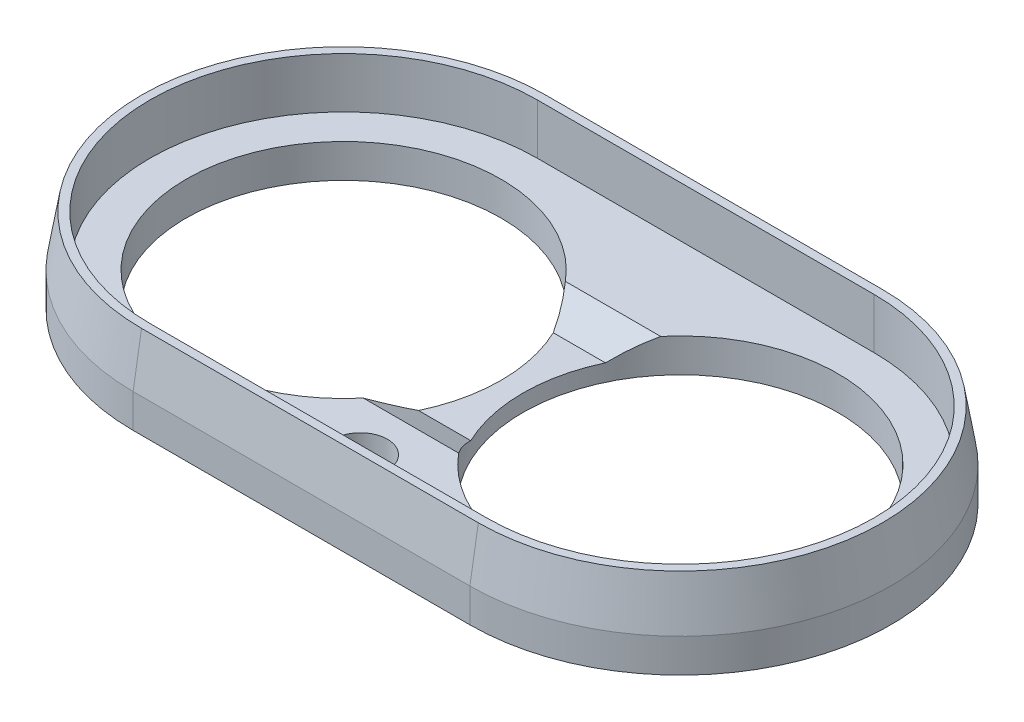
ISO-10303-21;
HEADER;
FILE_DESCRIPTION(('STEP AP214'),'2;1');
FILE_NAME('part.step','',(''),(''),'','','');
FILE_SCHEMA(('AUTOMOTIVE_DESIGN { 1 0 10303 214 1 1 1 1 }'));
ENDSEC;
DATA;
#1=APPLICATION_CONTEXT('core data for automotive mechanical design processes');
#2=APPLICATION_PROTOCOL_DEFINITION('international standard','automotive_design',2000,#1);
#3=PRODUCT_CONTEXT('',#1,'mechanical');
#4=PRODUCT('Part','Part','',(#3));
#5=PRODUCT_RELATED_PRODUCT_CATEGORY('part','',(#4));
#6=PRODUCT_DEFINITION_FORMATION('','',#4);
#7=PRODUCT_DEFINITION_CONTEXT('part definition',#1,'design');
#8=PRODUCT_DEFINITION('design','',#6,#7);
#9=PRODUCT_DEFINITION_SHAPE('','',#8);
#10=(LENGTH_UNIT() NAMED_UNIT(*) SI_UNIT(.MILLI.,.METRE.));
#11=(NAMED_UNIT(*) PLANE_ANGLE_UNIT() SI_UNIT($,.RADIAN.));
#12=(NAMED_UNIT(*) SI_UNIT($,.STERADIAN.) SOLID_ANGLE_UNIT());
#13=UNCERTAINTY_MEASURE_WITH_UNIT(LENGTH_MEASURE(1.E-05),#10,'distance_accuracy_value','');
#14=(GEOMETRIC_REPRESENTATION_CONTEXT(3) GLOBAL_UNCERTAINTY_ASSIGNED_CONTEXT((#13)) GLOBAL_UNIT_ASSIGNED_CONTEXT((#10,
#11,#12)) REPRESENTATION_CONTEXT('',''));
#15=CARTESIAN_POINT('',(0.,0.,0.));
#16=DIRECTION('',(0.,0.,1.));
#17=DIRECTION('',(1.,0.,0.));
#18=AXIS2_PLACEMENT_3D('',#15,#16,#17);
#19=CARTESIAN_POINT('',(0.,2.,12.5));
#20=DIRECTION('',(0.,0.,1.));
#21=DIRECTION('',(1.,0.,0.));
#22=AXIS2_PLACEMENT_3D('',#19,#20,#21);
#23=PLANE('',#22);
#24=DIRECTION('',(0.,-1.,0.));
#25=VECTOR('',#24,1.);
#26=CARTESIAN_POINT('',(10.,2.,12.5));
#27=LINE('',#26,#25);
#28=CARTESIAN_POINT('',(10.,1.99999999999995,12.5));
#29=VERTEX_POINT('',#28);
#30=CARTESIAN_POINT('',(10.,0.,12.5));
#31=VERTEX_POINT('',#30);
#32=EDGE_CURVE('E237',#29,#31,#27,.T.);
#33=ORIENTED_EDGE('',*,*,#32,.F.);
#34=DIRECTION('',(-1.,0.,0.));
#35=VECTOR('',#34,1.);
#36=CARTESIAN_POINT('',(0.,1.99999999999995,12.5));
#37=LINE('',#36,#35);
#38=CARTESIAN_POINT('',(-9.99999999999997,1.99999999999995,12.5));
#39=VERTEX_POINT('',#38);
#40=EDGE_CURVE('E253',#29,#39,#37,.T.);
#41=ORIENTED_EDGE('',*,*,#40,.T.);
#42=DIRECTION('',(0.,-1.,0.));
#43=VECTOR('',#42,1.);
#44=CARTESIAN_POINT('',(-9.99999999999997,2.,12.5));
#45=LINE('',#44,#43);
#46=CARTESIAN_POINT('',(-9.99999999999997,0.,12.5));
#47=VERTEX_POINT('',#46);
#48=EDGE_CURVE('E231',#39,#47,#45,.T.);
#49=ORIENTED_EDGE('',*,*,#48,.T.);
#50=DIRECTION('',(-1.,0.,0.));
#51=VECTOR('',#50,1.);
#52=CARTESIAN_POINT('',(0.,0.,12.5));
#53=LINE('',#52,#51);
#54=EDGE_CURVE('E215',#31,#47,#53,.T.);
#55=ORIENTED_EDGE('',*,*,#54,.F.);
#56=EDGE_LOOP('',(#33,#41,#49,#55));
#57=FACE_BOUND('',#56,.T.);
#58=ADVANCED_FACE('F40',(#57),#23,.T.);
#59=CARTESIAN_POINT('',(10.,2.,0.));
#60=DIRECTION('',(0.,-1.,0.));
#61=DIRECTION('',(0.,0.,-1.));
#62=AXIS2_PLACEMENT_3D('',#59,#60,#61);
#63=CYLINDRICAL_SURFACE('',#62,12.5);
#64=DIRECTION('',(0.,-1.,0.));
#65=VECTOR('',#64,1.);
#66=CARTESIAN_POINT('',(10.,2.,-12.5));
#67=LINE('',#66,#65);
#68=CARTESIAN_POINT('',(10.,1.99999999999995,-12.5));
#69=VERTEX_POINT('',#68);
#70=CARTESIAN_POINT('',(10.,0.,-12.5));
#71=VERTEX_POINT('',#70);
#72=EDGE_CURVE('E235',#69,#71,#67,.T.);
#73=ORIENTED_EDGE('',*,*,#72,.F.);
#74=CARTESIAN_POINT('',(10.,1.99999999999995,0.));
#75=DIRECTION('',(0.,1.,0.));
#76=DIRECTION('',(0.,0.,1.));
#77=AXIS2_PLACEMENT_3D('',#74,#75,#76);
#78=CIRCLE('',#77,12.5);
#79=EDGE_CURVE('E251',#69,#29,#78,.F.);
#80=ORIENTED_EDGE('',*,*,#79,.T.);
#81=ORIENTED_EDGE('',*,*,#32,.T.);
#82=CARTESIAN_POINT('',(10.,0.,0.));
#83=DIRECTION('',(0.,1.,0.));
#84=DIRECTION('',(0.,0.,1.));
#85=AXIS2_PLACEMENT_3D('',#82,#83,#84);
#86=CIRCLE('',#85,12.5);
#87=EDGE_CURVE('E222',#31,#71,#86,.T.);
#88=ORIENTED_EDGE('',*,*,#87,.T.);
#89=EDGE_LOOP('',(#73,#80,#81,#88));
#90=FACE_BOUND('',#89,.T.);
#91=ADVANCED_FACE('F286',(#90),#63,.T.);
#92=CARTESIAN_POINT('',(0.,2.,-12.5));
#93=DIRECTION('',(0.,0.,1.));
#94=DIRECTION('',(1.,0.,0.));
#95=AXIS2_PLACEMENT_3D('',#92,#93,#94);
#96=PLANE('',#95);
#97=DIRECTION('',(0.,-1.,0.));
#98=VECTOR('',#97,1.);
#99=CARTESIAN_POINT('',(-10.,2.,-12.5));
#100=LINE('',#99,#98);
#101=CARTESIAN_POINT('',(-10.,1.99999999999995,-12.5));
#102=VERTEX_POINT('',#101);
#103=CARTESIAN_POINT('',(-10.,0.,-12.5));
#104=VERTEX_POINT('',#103);
#105=EDGE_CURVE('E233',#102,#104,#100,.T.);
#106=ORIENTED_EDGE('',*,*,#105,.F.);
#107=DIRECTION('',(1.,0.,0.));
#108=VECTOR('',#107,1.);
#109=CARTESIAN_POINT('',(10.,1.99999999999995,-12.5));
#110=LINE('',#109,#108);
#111=EDGE_CURVE('E248',#102,#69,#110,.T.);
#112=ORIENTED_EDGE('',*,*,#111,.T.);
#113=ORIENTED_EDGE('',*,*,#72,.T.);
#114=DIRECTION('',(-1.,0.,0.));
#115=VECTOR('',#114,1.);
#116=CARTESIAN_POINT('',(0.,0.,-12.5));
#117=LINE('',#116,#115);
#118=EDGE_CURVE('E225',#71,#104,#117,.T.);
#119=ORIENTED_EDGE('',*,*,#118,.T.);
#120=EDGE_LOOP('',(#106,#112,#113,#119));
#121=FACE_BOUND('',#120,.T.);
#122=ADVANCED_FACE('F288',(#121),#96,.F.);
#123=CARTESIAN_POINT('',(-10.,2.,0.));
#124=DIRECTION('',(0.,-1.,0.));
#125=DIRECTION('',(0.,0.,-1.));
#126=AXIS2_PLACEMENT_3D('',#123,#124,#125);
#127=CYLINDRICAL_SURFACE('',#126,12.5);
#128=ORIENTED_EDGE('',*,*,#48,.F.);
#129=CARTESIAN_POINT('',(-10.,1.99999999999995,0.));
#130=DIRECTION('',(0.,1.,0.));
#131=DIRECTION('',(0.,0.,1.));
#132=AXIS2_PLACEMENT_3D('',#129,#130,#131);
#133=CIRCLE('',#132,12.5);
#134=EDGE_CURVE('E168',#39,#102,#133,.F.);
#135=ORIENTED_EDGE('',*,*,#134,.T.);
#136=ORIENTED_EDGE('',*,*,#105,.T.);
#137=CARTESIAN_POINT('',(-10.,0.,0.));
#138=DIRECTION('',(0.,1.,0.));
#139=DIRECTION('',(0.,0.,1.));
#140=AXIS2_PLACEMENT_3D('',#137,#138,#139);
#141=CIRCLE('',#140,12.5);
#142=EDGE_CURVE('E228',#47,#104,#141,.F.);
#143=ORIENTED_EDGE('',*,*,#142,.F.);
#144=EDGE_LOOP('',(#128,#135,#136,#143));
#145=FACE_BOUND('',#144,.T.);
#146=ADVANCED_FACE('F278',(#145),#127,.T.);
#147=CARTESIAN_POINT('',(0.,2.,0.));
#148=DIRECTION('',(0.,1.,0.));
#149=DIRECTION('',(0.,0.,1.));
#150=AXIS2_PLACEMENT_3D('',#147,#148,#149);
#151=PLANE('',#150);
#152=CARTESIAN_POINT('',(4.,2.,9.5));
#153=DIRECTION('',(0.,1.,0.));
#154=DIRECTION('',(0.,0.,1.));
#155=AXIS2_PLACEMENT_3D('',#152,#153,#154);
#156=CIRCLE('',#155,0.75);
#157=CARTESIAN_POINT('',(4.,2.,10.25));
#158=VERTEX_POINT('',#157);
#159=EDGE_CURVE('E152',#158,#158,#156,.T.);
#160=ORIENTED_EDGE('',*,*,#159,.F.);
#161=EDGE_LOOP('',(#160));
#162=FACE_BOUND('',#161,.T.);
#163=CARTESIAN_POINT('',(-4.,2.,9.5));
#164=DIRECTION('',(0.,1.,0.));
#165=DIRECTION('',(0.,0.,1.));
#166=AXIS2_PLACEMENT_3D('',#163,#164,#165);
#167=CIRCLE('',#166,0.75);
#168=CARTESIAN_POINT('',(-4.,2.,10.25));
#169=VERTEX_POINT('',#168);
#170=EDGE_CURVE('E385',#169,#169,#167,.T.);
#171=ORIENTED_EDGE('',*,*,#170,.F.);
#172=EDGE_LOOP('',(#171));
#173=FACE_BOUND('',#172,.T.);
#174=CARTESIAN_POINT('',(0.,2.,9.));
#175=DIRECTION('',(0.,1.,0.));
#176=DIRECTION('',(0.,0.,1.));
#177=AXIS2_PLACEMENT_3D('',#174,#175,#176);
#178=CIRCLE('',#177,1.6);
#179=CARTESIAN_POINT('',(0.,2.,10.6));
#180=VERTEX_POINT('',#179);
#181=EDGE_CURVE('E394',#180,#180,#178,.T.);
#182=ORIENTED_EDGE('',*,*,#181,.F.);
#183=EDGE_LOOP('',(#182));
#184=FACE_BOUND('',#183,.T.);
#185=DIRECTION('',(1.,0.,0.));
#186=VECTOR('',#185,1.);
#187=CARTESIAN_POINT('',(-7.5,2.,6.));
#188=LINE('',#187,#186);
#189=CARTESIAN_POINT('',(-2.82905166662038,2.,6.));
#190=VERTEX_POINT('',#189);
#191=CARTESIAN_POINT('',(2.82905166662038,2.,6.));
#192=VERTEX_POINT('',#191);
#193=EDGE_CURVE('E151',#190,#192,#188,.T.);
#194=ORIENTED_EDGE('',*,*,#193,.F.);
#195=CARTESIAN_POINT('',(-10.,2.,0.));
#196=DIRECTION('',(0.,1.,0.));
#197=DIRECTION('',(0.,0.,-1.));
#198=AXIS2_PLACEMENT_3D('',#195,#196,#197);
#199=CIRCLE('',#198,9.35);
#200=CARTESIAN_POINT('',(-2.82905166662038,2.,-6.));
#201=VERTEX_POINT('',#200);
#202=EDGE_CURVE('E149',#201,#190,#199,.T.);
#203=ORIENTED_EDGE('',*,*,#202,.F.);
#204=DIRECTION('',(-1.,0.,0.));
#205=VECTOR('',#204,1.);
#206=CARTESIAN_POINT('',(-7.5,2.,-6.));
#207=LINE('',#206,#205);
#208=CARTESIAN_POINT('',(2.82905166662038,2.,-6.));
#209=VERTEX_POINT('',#208);
#210=EDGE_CURVE('E143',#209,#201,#207,.T.);
#211=ORIENTED_EDGE('',*,*,#210,.F.);
#212=CARTESIAN_POINT('',(10.,2.,0.));
#213=DIRECTION('',(0.,1.,0.));
#214=DIRECTION('',(0.,0.,1.));
#215=AXIS2_PLACEMENT_3D('',#212,#213,#214);
#216=CIRCLE('',#215,9.35);
#217=EDGE_CURVE('E147',#192,#209,#216,.T.);
#218=ORIENTED_EDGE('',*,*,#217,.F.);
#219=EDGE_LOOP('',(#194,#203,#211,#218));
#220=FACE_BOUND('',#219,.T.);
#221=CARTESIAN_POINT('',(10.,2.,0.));
#222=DIRECTION('',(0.,1.,0.));
#223=DIRECTION('',(0.,0.,1.));
#224=AXIS2_PLACEMENT_3D('',#221,#222,#223);
#225=CIRCLE('',#224,11.5);
#226=CARTESIAN_POINT('',(10.,2.,11.5));
#227=VERTEX_POINT('',#226);
#228=CARTESIAN_POINT('',(10.,2.,-11.5));
#229=VERTEX_POINT('',#228);
#230=EDGE_CURVE('E194',#227,#229,#225,.T.);
#231=ORIENTED_EDGE('',*,*,#230,.T.);
#232=DIRECTION('',(-1.,0.,0.));
#233=VECTOR('',#232,1.);
#234=CARTESIAN_POINT('',(10.,2.,-11.5));
#235=LINE('',#234,#233);
#236=CARTESIAN_POINT('',(-10.,2.,-11.5));
#237=VERTEX_POINT('',#236);
#238=EDGE_CURVE('E196',#229,#237,#235,.T.);
#239=ORIENTED_EDGE('',*,*,#238,.T.);
#240=CARTESIAN_POINT('',(-10.,2.,0.));
#241=DIRECTION('',(0.,1.,0.));
#242=DIRECTION('',(0.,0.,1.));
#243=AXIS2_PLACEMENT_3D('',#240,#241,#242);
#244=CIRCLE('',#243,11.5);
#245=CARTESIAN_POINT('',(-10.,2.,11.5));
#246=VERTEX_POINT('',#245);
#247=EDGE_CURVE('E199',#237,#246,#244,.T.);
#248=ORIENTED_EDGE('',*,*,#247,.T.);
#249=DIRECTION('',(1.,0.,0.));
#250=VECTOR('',#249,1.);
#251=CARTESIAN_POINT('',(-9.99999999999998,2.,11.5));
#252=LINE('',#251,#250);
#253=EDGE_CURVE('E186',#246,#227,#252,.T.);
#254=ORIENTED_EDGE('',*,*,#253,.T.);
#255=EDGE_LOOP('',(#231,#239,#248,#254));
#256=FACE_BOUND('',#255,.T.);
#257=ADVANCED_FACE('F145',(#162,#173,#184,#220,#256),#151,.T.);
#258=CARTESIAN_POINT('',(0.,0.,0.));
#259=DIRECTION('',(0.,1.,0.));
#260=DIRECTION('',(0.,0.,1.));
#261=AXIS2_PLACEMENT_3D('',#258,#259,#260);
#262=PLANE('',#261);
#263=CARTESIAN_POINT('',(4.,0.,9.5));
#264=DIRECTION('',(0.,-1.,0.));
#265=DIRECTION('',(0.,0.,-1.));
#266=AXIS2_PLACEMENT_3D('',#263,#264,#265);
#267=CIRCLE('',#266,0.75);
#268=CARTESIAN_POINT('',(4.,0.,8.75));
#269=VERTEX_POINT('',#268);
#270=EDGE_CURVE('E391',#269,#269,#267,.T.);
#271=ORIENTED_EDGE('',*,*,#270,.F.);
#272=EDGE_LOOP('',(#271));
#273=FACE_BOUND('',#272,.T.);
#274=CARTESIAN_POINT('',(-4.,0.,9.5));
#275=DIRECTION('',(0.,-1.,0.));
#276=DIRECTION('',(0.,0.,-1.));
#277=AXIS2_PLACEMENT_3D('',#274,#275,#276);
#278=CIRCLE('',#277,0.75);
#279=CARTESIAN_POINT('',(-4.,0.,8.75));
#280=VERTEX_POINT('',#279);
#281=EDGE_CURVE('E388',#280,#280,#278,.T.);
#282=ORIENTED_EDGE('',*,*,#281,.F.);
#283=EDGE_LOOP('',(#282));
#284=FACE_BOUND('',#283,.T.);
#285=CARTESIAN_POINT('',(0.,0.,9.));
#286=DIRECTION('',(0.,-1.,0.));
#287=DIRECTION('',(0.,0.,-1.));
#288=AXIS2_PLACEMENT_3D('',#285,#286,#287);
#289=CIRCLE('',#288,1.6);
#290=CARTESIAN_POINT('',(0.,0.,7.4));
#291=VERTEX_POINT('',#290);
#292=EDGE_CURVE('E390',#291,#291,#289,.T.);
#293=ORIENTED_EDGE('',*,*,#292,.F.);
#294=EDGE_LOOP('',(#293));
#295=FACE_BOUND('',#294,.T.);
#296=CARTESIAN_POINT('',(10.,0.,0.));
#297=DIRECTION('',(0.,1.,0.));
#298=DIRECTION('',(0.,0.,1.));
#299=AXIS2_PLACEMENT_3D('',#296,#297,#298);
#300=CIRCLE('',#299,9.35);
#301=CARTESIAN_POINT('',(10.,0.,9.35));
#302=VERTEX_POINT('',#301);
#303=EDGE_CURVE('E159',#302,#302,#300,.T.);
#304=ORIENTED_EDGE('',*,*,#303,.T.);
#305=EDGE_LOOP('',(#304));
#306=FACE_BOUND('',#305,.T.);
#307=CARTESIAN_POINT('',(-10.,0.,0.));
#308=DIRECTION('',(0.,1.,0.));
#309=DIRECTION('',(0.,0.,-1.));
#310=AXIS2_PLACEMENT_3D('',#307,#308,#309);
#311=CIRCLE('',#310,9.35);
#312=CARTESIAN_POINT('',(-10.,0.,-9.35));
#313=VERTEX_POINT('',#312);
#314=EDGE_CURVE('E213',#313,#313,#311,.T.);
#315=ORIENTED_EDGE('',*,*,#314,.T.);
#316=EDGE_LOOP('',(#315));
#317=FACE_BOUND('',#316,.T.);
#318=ORIENTED_EDGE('',*,*,#54,.T.);
#319=ORIENTED_EDGE('',*,*,#142,.T.);
#320=ORIENTED_EDGE('',*,*,#118,.F.);
#321=ORIENTED_EDGE('',*,*,#87,.F.);
#322=EDGE_LOOP('',(#318,#319,#320,#321));
#323=FACE_BOUND('',#322,.T.);
#324=ADVANCED_FACE('F282',(#273,#284,#295,#306,#317,#323),#262,.F.);
#325=CARTESIAN_POINT('',(-10.,0.,0.));
#326=DIRECTION('',(0.,1.,0.));
#327=DIRECTION('',(0.,0.,1.));
#328=AXIS2_PLACEMENT_3D('',#325,#326,#327);
#329=CYLINDRICAL_SURFACE('',#328,9.35);
#330=ORIENTED_EDGE('',*,*,#202,.T.);
#331=CARTESIAN_POINT('',(-10.,-1.00000000000002,0.));
#332=DIRECTION('',(0.,0.894427190999915,-0.44721359549996));
#333=DIRECTION('',(0.,0.44721359549996,0.894427190999915));
#334=AXIS2_PLACEMENT_3D('',#331,#332,#333);
#335=ELLIPSE('',#334,10.4536177948115,9.35);
#336=CARTESIAN_POINT('',(-1.54881665090623,1.,4.00000000000001));
#337=VERTEX_POINT('',#336);
#338=EDGE_CURVE('E63',#190,#337,#335,.T.);
#339=ORIENTED_EDGE('',*,*,#338,.T.);
#340=CARTESIAN_POINT('',(-10.,1.,0.));
#341=DIRECTION('',(0.,-1.,0.));
#342=DIRECTION('',(0.,0.,-1.));
#343=AXIS2_PLACEMENT_3D('',#340,#341,#342);
#344=CIRCLE('',#343,9.35);
#345=CARTESIAN_POINT('',(-1.54881665090623,1.,-4.00000000000001));
#346=VERTEX_POINT('',#345);
#347=EDGE_CURVE('E175',#337,#346,#344,.F.);
#348=ORIENTED_EDGE('',*,*,#347,.T.);
#349=CARTESIAN_POINT('',(-10.,-1.00000000000002,0.));
#350=DIRECTION('',(0.,0.894427190999915,0.44721359549996));
#351=DIRECTION('',(0.,0.44721359549996,-0.894427190999915));
#352=AXIS2_PLACEMENT_3D('',#349,#350,#351);
#353=ELLIPSE('',#352,10.4536177948115,9.35);
#354=EDGE_CURVE('E49',#346,#201,#353,.T.);
#355=ORIENTED_EDGE('',*,*,#354,.T.);
#356=EDGE_LOOP('',(#330,#339,#348,#355));
#357=FACE_BOUND('',#356,.T.);
#358=ORIENTED_EDGE('',*,*,#314,.F.);
#359=EDGE_LOOP('',(#358));
#360=FACE_BOUND('',#359,.T.);
#361=ADVANCED_FACE('F173',(#357,#360),#329,.F.);
#362=CARTESIAN_POINT('',(10.,0.,0.));
#363=DIRECTION('',(0.,1.,0.));
#364=DIRECTION('',(0.,0.,1.));
#365=AXIS2_PLACEMENT_3D('',#362,#363,#364);
#366=CYLINDRICAL_SURFACE('',#365,9.35);
#367=ORIENTED_EDGE('',*,*,#303,.F.);
#368=EDGE_LOOP('',(#367));
#369=FACE_BOUND('',#368,.T.);
#370=ORIENTED_EDGE('',*,*,#217,.T.);
#371=CARTESIAN_POINT('',(10.,-1.00000000000002,0.));
#372=DIRECTION('',(0.,0.894427190999915,0.44721359549996));
#373=DIRECTION('',(0.,0.44721359549996,-0.894427190999915));
#374=AXIS2_PLACEMENT_3D('',#371,#372,#373);
#375=ELLIPSE('',#374,10.4536177948115,9.35);
#376=CARTESIAN_POINT('',(1.54881665090623,1.,-4.00000000000001));
#377=VERTEX_POINT('',#376);
#378=EDGE_CURVE('E11',#209,#377,#375,.T.);
#379=ORIENTED_EDGE('',*,*,#378,.T.);
#380=CARTESIAN_POINT('',(10.,1.,0.));
#381=DIRECTION('',(0.,-1.,0.));
#382=DIRECTION('',(0.,0.,-1.));
#383=AXIS2_PLACEMENT_3D('',#380,#381,#382);
#384=CIRCLE('',#383,9.35);
#385=CARTESIAN_POINT('',(1.54881665090623,1.,4.00000000000001));
#386=VERTEX_POINT('',#385);
#387=EDGE_CURVE('E164',#377,#386,#384,.F.);
#388=ORIENTED_EDGE('',*,*,#387,.T.);
#389=CARTESIAN_POINT('',(10.,-1.00000000000002,0.));
#390=DIRECTION('',(0.,0.894427190999915,-0.44721359549996));
#391=DIRECTION('',(0.,0.44721359549996,0.894427190999915));
#392=AXIS2_PLACEMENT_3D('',#389,#390,#391);
#393=ELLIPSE('',#392,10.4536177948115,9.35);
#394=EDGE_CURVE('E158',#386,#192,#393,.T.);
#395=ORIENTED_EDGE('',*,*,#394,.T.);
#396=EDGE_LOOP('',(#370,#379,#388,#395));
#397=FACE_BOUND('',#396,.T.);
#398=ADVANCED_FACE('F155',(#369,#397),#366,.F.);
#399=CARTESIAN_POINT('',(10.,5.,0.));
#400=DIRECTION('',(0.,1.,0.));
#401=DIRECTION('',(0.,0.,1.));
#402=AXIS2_PLACEMENT_3D('',#399,#400,#401);
#403=PLANE('',#402);
#404=CARTESIAN_POINT('',(10.,5.,0.));
#405=DIRECTION('',(0.,1.,0.));
#406=DIRECTION('',(0.,0.,1.));
#407=AXIS2_PLACEMENT_3D('',#404,#405,#406);
#408=CIRCLE('',#407,12.);
#409=CARTESIAN_POINT('',(10.,5.,12.));
#410=VERTEX_POINT('',#409);
#411=CARTESIAN_POINT('',(10.,5.,-12.));
#412=VERTEX_POINT('',#411);
#413=EDGE_CURVE('E243',#410,#412,#408,.T.);
#414=ORIENTED_EDGE('',*,*,#413,.T.);
#415=DIRECTION('',(-1.,0.,0.));
#416=VECTOR('',#415,1.);
#417=CARTESIAN_POINT('',(-10.,5.,-12.));
#418=LINE('',#417,#416);
#419=CARTESIAN_POINT('',(-10.,5.,-12.));
#420=VERTEX_POINT('',#419);
#421=EDGE_CURVE('E245',#412,#420,#418,.T.);
#422=ORIENTED_EDGE('',*,*,#421,.T.);
#423=CARTESIAN_POINT('',(-10.,5.,0.));
#424=DIRECTION('',(0.,1.,0.));
#425=DIRECTION('',(0.,0.,1.));
#426=AXIS2_PLACEMENT_3D('',#423,#424,#425);
#427=CIRCLE('',#426,12.);
#428=CARTESIAN_POINT('',(-9.99999999999997,5.,12.));
#429=VERTEX_POINT('',#428);
#430=EDGE_CURVE('E239',#420,#429,#427,.T.);
#431=ORIENTED_EDGE('',*,*,#430,.T.);
#432=DIRECTION('',(1.,0.,0.));
#433=VECTOR('',#432,1.);
#434=CARTESIAN_POINT('',(10.,5.,12.));
#435=LINE('',#434,#433);
#436=EDGE_CURVE('E241',#429,#410,#435,.T.);
#437=ORIENTED_EDGE('',*,*,#436,.T.);
#438=EDGE_LOOP('',(#414,#422,#431,#437));
#439=FACE_BOUND('',#438,.T.);
#440=DIRECTION('',(-1.,0.,0.));
#441=VECTOR('',#440,1.);
#442=CARTESIAN_POINT('',(10.,5.,-11.5));
#443=LINE('',#442,#441);
#444=CARTESIAN_POINT('',(10.,5.,-11.5));
#445=VERTEX_POINT('',#444);
#446=CARTESIAN_POINT('',(-10.,5.,-11.5));
#447=VERTEX_POINT('',#446);
#448=EDGE_CURVE('E185',#445,#447,#443,.T.);
#449=ORIENTED_EDGE('',*,*,#448,.F.);
#450=CARTESIAN_POINT('',(10.,5.,0.));
#451=DIRECTION('',(0.,1.,0.));
#452=DIRECTION('',(0.,0.,1.));
#453=AXIS2_PLACEMENT_3D('',#450,#451,#452);
#454=CIRCLE('',#453,11.5);
#455=CARTESIAN_POINT('',(10.,5.,11.5));
#456=VERTEX_POINT('',#455);
#457=EDGE_CURVE('E183',#456,#445,#454,.T.);
#458=ORIENTED_EDGE('',*,*,#457,.F.);
#459=DIRECTION('',(1.,0.,0.));
#460=VECTOR('',#459,1.);
#461=CARTESIAN_POINT('',(-9.99999999999998,5.,11.5));
#462=LINE('',#461,#460);
#463=CARTESIAN_POINT('',(-10.,5.,11.5));
#464=VERTEX_POINT('',#463);
#465=EDGE_CURVE('E191',#464,#456,#462,.T.);
#466=ORIENTED_EDGE('',*,*,#465,.F.);
#467=CARTESIAN_POINT('',(-10.,5.,0.));
#468=DIRECTION('',(0.,1.,0.));
#469=DIRECTION('',(0.,0.,1.));
#470=AXIS2_PLACEMENT_3D('',#467,#468,#469);
#471=CIRCLE('',#470,11.5);
#472=EDGE_CURVE('E188',#447,#464,#471,.T.);
#473=ORIENTED_EDGE('',*,*,#472,.F.);
#474=EDGE_LOOP('',(#449,#458,#466,#473));
#475=FACE_BOUND('',#474,.T.);
#476=ADVANCED_FACE('F298',(#439,#475),#403,.T.);
#477=CARTESIAN_POINT('',(10.,5.,0.));
#478=DIRECTION('',(0.,-1.,0.));
#479=DIRECTION('',(0.,0.,-1.));
#480=AXIS2_PLACEMENT_3D('',#477,#478,#479);
#481=CYLINDRICAL_SURFACE('',#480,11.5);
#482=ORIENTED_EDGE('',*,*,#230,.F.);
#483=DIRECTION('',(0.,-1.,0.));
#484=VECTOR('',#483,1.);
#485=CARTESIAN_POINT('',(10.,5.,11.5));
#486=LINE('',#485,#484);
#487=EDGE_CURVE('E193',#456,#227,#486,.T.);
#488=ORIENTED_EDGE('',*,*,#487,.F.);
#489=ORIENTED_EDGE('',*,*,#457,.T.);
#490=DIRECTION('',(0.,-1.,0.));
#491=VECTOR('',#490,1.);
#492=CARTESIAN_POINT('',(10.,5.,-11.5));
#493=LINE('',#492,#491);
#494=EDGE_CURVE('E210',#445,#229,#493,.T.);
#495=ORIENTED_EDGE('',*,*,#494,.T.);
#496=EDGE_LOOP('',(#482,#488,#489,#495));
#497=FACE_BOUND('',#496,.T.);
#498=ADVANCED_FACE('F301',(#497),#481,.F.);
#499=CARTESIAN_POINT('',(10.,5.,-11.5));
#500=DIRECTION('',(0.,0.,1.));
#501=DIRECTION('',(1.,0.,0.));
#502=AXIS2_PLACEMENT_3D('',#499,#500,#501);
#503=PLANE('',#502);
#504=ORIENTED_EDGE('',*,*,#238,.F.);
#505=ORIENTED_EDGE('',*,*,#494,.F.);
#506=ORIENTED_EDGE('',*,*,#448,.T.);
#507=DIRECTION('',(0.,-1.,0.));
#508=VECTOR('',#507,1.);
#509=CARTESIAN_POINT('',(-10.,5.,-11.5));
#510=LINE('',#509,#508);
#511=EDGE_CURVE('E207',#447,#237,#510,.T.);
#512=ORIENTED_EDGE('',*,*,#511,.T.);
#513=EDGE_LOOP('',(#504,#505,#506,#512));
#514=FACE_BOUND('',#513,.T.);
#515=ADVANCED_FACE('F311',(#514),#503,.T.);
#516=CARTESIAN_POINT('',(-10.,5.,0.));
#517=DIRECTION('',(0.,-1.,0.));
#518=DIRECTION('',(0.,0.,-1.));
#519=AXIS2_PLACEMENT_3D('',#516,#517,#518);
#520=CYLINDRICAL_SURFACE('',#519,11.5);
#521=ORIENTED_EDGE('',*,*,#247,.F.);
#522=ORIENTED_EDGE('',*,*,#511,.F.);
#523=ORIENTED_EDGE('',*,*,#472,.T.);
#524=DIRECTION('',(0.,-1.,0.));
#525=VECTOR('',#524,1.);
#526=CARTESIAN_POINT('',(-10.,5.,11.5));
#527=LINE('',#526,#525);
#528=EDGE_CURVE('E204',#464,#246,#527,.T.);
#529=ORIENTED_EDGE('',*,*,#528,.T.);
#530=EDGE_LOOP('',(#521,#522,#523,#529));
#531=FACE_BOUND('',#530,.T.);
#532=ADVANCED_FACE('F314',(#531),#520,.F.);
#533=CARTESIAN_POINT('',(-9.99999999999998,5.,11.5));
#534=DIRECTION('',(0.,0.,-1.));
#535=DIRECTION('',(-1.,0.,0.));
#536=AXIS2_PLACEMENT_3D('',#533,#534,#535);
#537=PLANE('',#536);
#538=ORIENTED_EDGE('',*,*,#253,.F.);
#539=ORIENTED_EDGE('',*,*,#528,.F.);
#540=ORIENTED_EDGE('',*,*,#465,.T.);
#541=ORIENTED_EDGE('',*,*,#487,.T.);
#542=EDGE_LOOP('',(#538,#539,#540,#541));
#543=FACE_BOUND('',#542,.T.);
#544=ADVANCED_FACE('F320',(#543),#537,.T.);
#545=CARTESIAN_POINT('',(10.,5.,12.));
#546=DIRECTION('',(0.,-0.164398987305354,-0.986393923832144));
#547=DIRECTION('',(1.,0.,0.));
#548=AXIS2_PLACEMENT_3D('',#545,#546,#547);
#549=PLANE('',#548);
#550=DIRECTION('',(0.,0.986393923832144,-0.164398987305354));
#551=VECTOR('',#550,1.);
#552=CARTESIAN_POINT('',(-9.99999999999997,1.99999999999995,12.5));
#553=LINE('',#552,#551);
#554=EDGE_CURVE('E257',#39,#429,#553,.T.);
#555=ORIENTED_EDGE('',*,*,#554,.F.);
#556=ORIENTED_EDGE('',*,*,#40,.F.);
#557=DIRECTION('',(0.,-0.986393923832144,0.164398987305354));
#558=VECTOR('',#557,1.);
#559=CARTESIAN_POINT('',(10.,5.,12.));
#560=LINE('',#559,#558);
#561=EDGE_CURVE('E197',#410,#29,#560,.T.);
#562=ORIENTED_EDGE('',*,*,#561,.F.);
#563=ORIENTED_EDGE('',*,*,#436,.F.);
#564=EDGE_LOOP('',(#555,#556,#562,#563));
#565=FACE_BOUND('',#564,.T.);
#566=ADVANCED_FACE('F270',(#565),#549,.F.);
#567=CARTESIAN_POINT('',(10.,5.,0.));
#568=DIRECTION('',(0.,-1.,0.));
#569=DIRECTION('',(0.,0.,-1.));
#570=AXIS2_PLACEMENT_3D('',#567,#568,#569);
#571=CONICAL_SURFACE('',#570,12.,0.165148677414623);
#572=ORIENTED_EDGE('',*,*,#561,.T.);
#573=ORIENTED_EDGE('',*,*,#79,.F.);
#574=DIRECTION('',(0.,-0.986393923832144,-0.164398987305354));
#575=VECTOR('',#574,1.);
#576=CARTESIAN_POINT('',(10.,5.,-12.));
#577=LINE('',#576,#575);
#578=EDGE_CURVE('E179',#412,#69,#577,.T.);
#579=ORIENTED_EDGE('',*,*,#578,.F.);
#580=ORIENTED_EDGE('',*,*,#413,.F.);
#581=EDGE_LOOP('',(#572,#573,#579,#580));
#582=FACE_BOUND('',#581,.T.);
#583=ADVANCED_FACE('F264',(#582),#571,.T.);
#584=CARTESIAN_POINT('',(-10.,5.,0.));
#585=DIRECTION('',(0.,-1.,0.));
#586=DIRECTION('',(0.,0.,-1.));
#587=AXIS2_PLACEMENT_3D('',#584,#585,#586);
#588=CONICAL_SURFACE('',#587,12.,0.165148677414623);
#589=ORIENTED_EDGE('',*,*,#554,.T.);
#590=ORIENTED_EDGE('',*,*,#430,.F.);
#591=DIRECTION('',(0.,0.986393923832144,0.164398987305354));
#592=VECTOR('',#591,1.);
#593=CARTESIAN_POINT('',(-10.,1.99999999999995,-12.5));
#594=LINE('',#593,#592);
#595=EDGE_CURVE('E177',#102,#420,#594,.T.);
#596=ORIENTED_EDGE('',*,*,#595,.F.);
#597=ORIENTED_EDGE('',*,*,#134,.F.);
#598=EDGE_LOOP('',(#589,#590,#596,#597));
#599=FACE_BOUND('',#598,.T.);
#600=ADVANCED_FACE('F296',(#599),#588,.T.);
#601=CARTESIAN_POINT('',(10.,5.,-12.));
#602=DIRECTION('',(0.,0.164398987305354,-0.986393923832144));
#603=DIRECTION('',(1.,0.,0.));
#604=AXIS2_PLACEMENT_3D('',#601,#602,#603);
#605=PLANE('',#604);
#606=ORIENTED_EDGE('',*,*,#578,.T.);
#607=ORIENTED_EDGE('',*,*,#111,.F.);
#608=ORIENTED_EDGE('',*,*,#595,.T.);
#609=ORIENTED_EDGE('',*,*,#421,.F.);
#610=EDGE_LOOP('',(#606,#607,#608,#609));
#611=FACE_BOUND('',#610,.T.);
#612=ADVANCED_FACE('F292',(#611),#605,.T.);
#613=CARTESIAN_POINT('',(0.,1.,0.));
#614=DIRECTION('',(0.,-1.,0.));
#615=DIRECTION('',(0.,0.,-1.));
#616=AXIS2_PLACEMENT_3D('',#613,#614,#615);
#617=PLANE('',#616);
#618=ORIENTED_EDGE('',*,*,#347,.F.);
#619=DIRECTION('',(1.,0.,0.));
#620=VECTOR('',#619,1.);
#621=CARTESIAN_POINT('',(2.82905166662038,1.,4.00000000000001));
#622=LINE('',#621,#620);
#623=EDGE_CURVE('E163',#337,#386,#622,.T.);
#624=ORIENTED_EDGE('',*,*,#623,.T.);
#625=ORIENTED_EDGE('',*,*,#387,.F.);
#626=DIRECTION('',(-1.,0.,0.));
#627=VECTOR('',#626,1.);
#628=CARTESIAN_POINT('',(-2.82905166662038,1.,-4.00000000000001));
#629=LINE('',#628,#627);
#630=EDGE_CURVE('E161',#377,#346,#629,.T.);
#631=ORIENTED_EDGE('',*,*,#630,.T.);
#632=EDGE_LOOP('',(#618,#624,#625,#631));
#633=FACE_BOUND('',#632,.T.);
#634=ADVANCED_FACE('F345',(#633),#617,.F.);
#635=CARTESIAN_POINT('',(0.,1.,4.00000000000001));
#636=DIRECTION('',(0.,0.894427190999915,-0.44721359549996));
#637=DIRECTION('',(-1.,0.,0.));
#638=AXIS2_PLACEMENT_3D('',#635,#636,#637);
#639=PLANE('',#638);
#640=ORIENTED_EDGE('',*,*,#338,.F.);
#641=ORIENTED_EDGE('',*,*,#193,.T.);
#642=ORIENTED_EDGE('',*,*,#394,.F.);
#643=ORIENTED_EDGE('',*,*,#623,.F.);
#644=EDGE_LOOP('',(#640,#641,#642,#643));
#645=FACE_BOUND('',#644,.T.);
#646=ADVANCED_FACE('F357',(#645),#639,.T.);
#647=CARTESIAN_POINT('',(0.,1.,-4.00000000000001));
#648=DIRECTION('',(0.,0.894427190999915,0.44721359549996));
#649=DIRECTION('',(1.,0.,0.));
#650=AXIS2_PLACEMENT_3D('',#647,#648,#649);
#651=PLANE('',#650);
#652=ORIENTED_EDGE('',*,*,#378,.F.);
#653=ORIENTED_EDGE('',*,*,#210,.T.);
#654=ORIENTED_EDGE('',*,*,#354,.F.);
#655=ORIENTED_EDGE('',*,*,#630,.F.);
#656=EDGE_LOOP('',(#652,#653,#654,#655));
#657=FACE_BOUND('',#656,.T.);
#658=ADVANCED_FACE('F43',(#657),#651,.T.);
#659=CARTESIAN_POINT('',(0.,5.,9.));
#660=DIRECTION('',(0.,-1.,0.));
#661=DIRECTION('',(0.,0.,-1.));
#662=AXIS2_PLACEMENT_3D('',#659,#660,#661);
#663=CYLINDRICAL_SURFACE('',#662,1.6);
#664=ORIENTED_EDGE('',*,*,#181,.T.);
#665=EDGE_LOOP('',(#664));
#666=FACE_BOUND('',#665,.T.);
#667=ORIENTED_EDGE('',*,*,#292,.T.);
#668=EDGE_LOOP('',(#667));
#669=FACE_BOUND('',#668,.T.);
#670=ADVANCED_FACE('F366',(#666,#669),#663,.F.);
#671=CARTESIAN_POINT('',(-4.,5.,9.5));
#672=DIRECTION('',(0.,-1.,0.));
#673=DIRECTION('',(0.,0.,-1.));
#674=AXIS2_PLACEMENT_3D('',#671,#672,#673);
#675=CYLINDRICAL_SURFACE('',#674,0.75);
#676=ORIENTED_EDGE('',*,*,#170,.T.);
#677=EDGE_LOOP('',(#676));
#678=FACE_BOUND('',#677,.T.);
#679=ORIENTED_EDGE('',*,*,#281,.T.);
#680=EDGE_LOOP('',(#679));
#681=FACE_BOUND('',#680,.T.);
#682=ADVANCED_FACE('F372',(#678,#681),#675,.F.);
#683=CARTESIAN_POINT('',(4.,5.,9.5));
#684=DIRECTION('',(0.,-1.,0.));
#685=DIRECTION('',(0.,0.,-1.));
#686=AXIS2_PLACEMENT_3D('',#683,#684,#685);
#687=CYLINDRICAL_SURFACE('',#686,0.75);
#688=ORIENTED_EDGE('',*,*,#159,.T.);
#689=EDGE_LOOP('',(#688));
#690=FACE_BOUND('',#689,.T.);
#691=ORIENTED_EDGE('',*,*,#270,.T.);
#692=EDGE_LOOP('',(#691));
#693=FACE_BOUND('',#692,.T.);
#694=ADVANCED_FACE('F374',(#690,#693),#687,.F.);
#695=CLOSED_SHELL('',(#58,#91,#122,#146,#257,#324,#361,#398,#476,#498,#515,#532,#544,#566,#583,
#600,#612,#634,#646,#658,#670,#682,#694));
#696=MANIFOLD_SOLID_BREP('B2',#695);
#697=ADVANCED_BREP_SHAPE_REPRESENTATION('',(#18,#696),#14);
#698=SHAPE_DEFINITION_REPRESENTATION(#9,#697);
ENDSEC;
END-ISO-10303-21;
